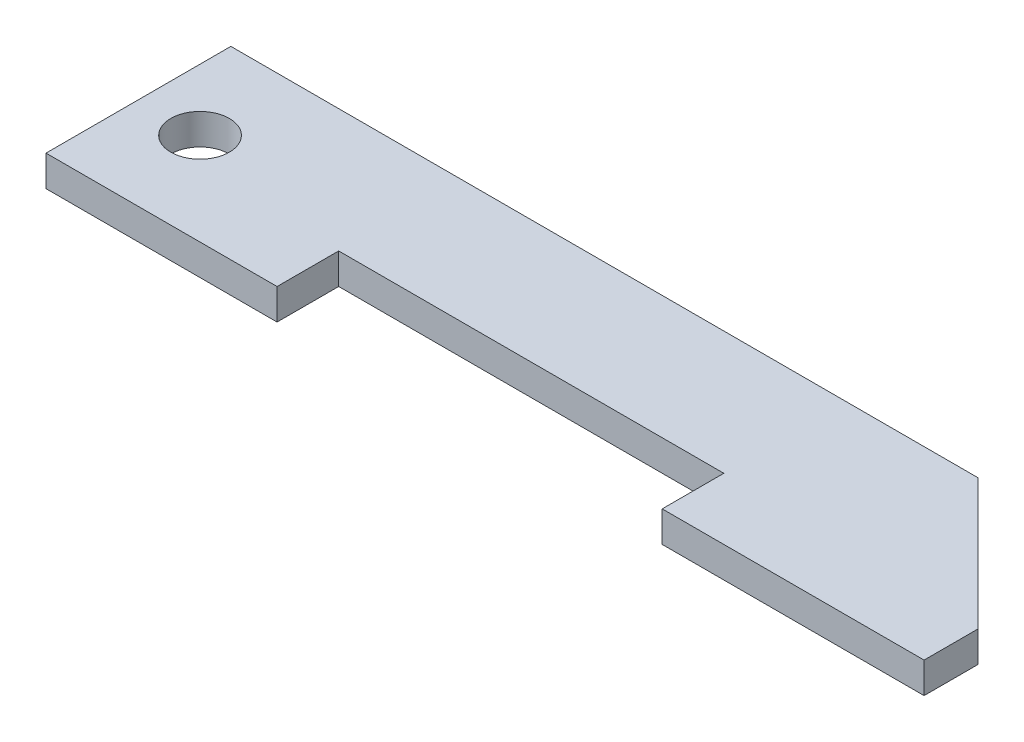
ISO-10303-21;
HEADER;
FILE_DESCRIPTION(('STEP AP214'),'2;1');
FILE_NAME('part.step','',(''),(''),'','','');
FILE_SCHEMA(('AUTOMOTIVE_DESIGN { 1 0 10303 214 1 1 1 1 }'));
ENDSEC;
DATA;
#1=APPLICATION_CONTEXT('core data for automotive mechanical design processes');
#2=APPLICATION_PROTOCOL_DEFINITION('international standard','automotive_design',2000,#1);
#3=PRODUCT_CONTEXT('',#1,'mechanical');
#4=PRODUCT('Part','Part','',(#3));
#5=PRODUCT_RELATED_PRODUCT_CATEGORY('part','',(#4));
#6=PRODUCT_DEFINITION_FORMATION('','',#4);
#7=PRODUCT_DEFINITION_CONTEXT('part definition',#1,'design');
#8=PRODUCT_DEFINITION('design','',#6,#7);
#9=PRODUCT_DEFINITION_SHAPE('','',#8);
#10=(LENGTH_UNIT() NAMED_UNIT(*) SI_UNIT(.MILLI.,.METRE.));
#11=(NAMED_UNIT(*) PLANE_ANGLE_UNIT() SI_UNIT($,.RADIAN.));
#12=(NAMED_UNIT(*) SI_UNIT($,.STERADIAN.) SOLID_ANGLE_UNIT());
#13=UNCERTAINTY_MEASURE_WITH_UNIT(LENGTH_MEASURE(1.E-05),#10,'distance_accuracy_value','');
#14=(GEOMETRIC_REPRESENTATION_CONTEXT(3) GLOBAL_UNCERTAINTY_ASSIGNED_CONTEXT((#13)) GLOBAL_UNIT_ASSIGNED_CONTEXT((#10,
#11,#12)) REPRESENTATION_CONTEXT('',''));
#15=CARTESIAN_POINT('',(0.,0.,0.));
#16=DIRECTION('',(0.,0.,1.));
#17=DIRECTION('',(1.,0.,0.));
#18=AXIS2_PLACEMENT_3D('',#15,#16,#17);
#19=CARTESIAN_POINT('',(0.,2.,0.));
#20=DIRECTION('',(0.,-1.,0.));
#21=DIRECTION('',(0.,0.,-1.));
#22=AXIS2_PLACEMENT_3D('',#19,#20,#21);
#23=PLANE('',#22);
#24=DIRECTION('',(0.,0.,1.));
#25=VECTOR('',#24,1.);
#26=CARTESIAN_POINT('',(0.,2.,12.));
#27=LINE('',#26,#25);
#28=CARTESIAN_POINT('',(0.,2.,0.));
#29=VERTEX_POINT('',#28);
#30=CARTESIAN_POINT('',(0.,2.,12.));
#31=VERTEX_POINT('',#30);
#32=EDGE_CURVE('E151',#29,#31,#27,.T.);
#33=ORIENTED_EDGE('',*,*,#32,.T.);
#34=DIRECTION('',(1.,0.,0.));
#35=VECTOR('',#34,1.);
#36=CARTESIAN_POINT('',(15.,2.,12.));
#37=LINE('',#36,#35);
#38=CARTESIAN_POINT('',(15.,2.,12.));
#39=VERTEX_POINT('',#38);
#40=EDGE_CURVE('E94',#31,#39,#37,.T.);
#41=ORIENTED_EDGE('',*,*,#40,.T.);
#42=DIRECTION('',(0.,0.,-1.));
#43=VECTOR('',#42,1.);
#44=CARTESIAN_POINT('',(15.,2.,8.));
#45=LINE('',#44,#43);
#46=CARTESIAN_POINT('',(15.,2.,8.));
#47=VERTEX_POINT('',#46);
#48=EDGE_CURVE('E169',#39,#47,#45,.T.);
#49=ORIENTED_EDGE('',*,*,#48,.T.);
#50=DIRECTION('',(1.,0.,0.));
#51=VECTOR('',#50,1.);
#52=CARTESIAN_POINT('',(40.,2.,8.));
#53=LINE('',#52,#51);
#54=CARTESIAN_POINT('',(40.,2.,8.));
#55=VERTEX_POINT('',#54);
#56=EDGE_CURVE('E186',#47,#55,#53,.T.);
#57=ORIENTED_EDGE('',*,*,#56,.T.);
#58=DIRECTION('',(0.,0.,1.));
#59=VECTOR('',#58,1.);
#60=CARTESIAN_POINT('',(40.,2.,12.));
#61=LINE('',#60,#59);
#62=CARTESIAN_POINT('',(40.,2.,12.));
#63=VERTEX_POINT('',#62);
#64=EDGE_CURVE('E185',#55,#63,#61,.T.);
#65=ORIENTED_EDGE('',*,*,#64,.T.);
#66=DIRECTION('',(1.,0.,0.));
#67=VECTOR('',#66,1.);
#68=CARTESIAN_POINT('',(57.,2.,12.));
#69=LINE('',#68,#67);
#70=CARTESIAN_POINT('',(57.,2.,12.));
#71=VERTEX_POINT('',#70);
#72=EDGE_CURVE('E116',#63,#71,#69,.T.);
#73=ORIENTED_EDGE('',*,*,#72,.T.);
#74=DIRECTION('',(0.,0.,-1.));
#75=VECTOR('',#74,1.);
#76=CARTESIAN_POINT('',(57.,2.,8.49999999999999));
#77=LINE('',#76,#75);
#78=CARTESIAN_POINT('',(57.,2.,8.49999999999999));
#79=VERTEX_POINT('',#78);
#80=EDGE_CURVE('E110',#71,#79,#77,.T.);
#81=ORIENTED_EDGE('',*,*,#80,.T.);
#82=DIRECTION('',(-0.707106781186552,0.,-0.707106781186543));
#83=VECTOR('',#82,1.);
#84=CARTESIAN_POINT('',(48.4999999999999,2.,0.));
#85=LINE('',#84,#83);
#86=CARTESIAN_POINT('',(48.4999999999999,2.,0.));
#87=VERTEX_POINT('',#86);
#88=EDGE_CURVE('E114',#79,#87,#85,.T.);
#89=ORIENTED_EDGE('',*,*,#88,.T.);
#90=DIRECTION('',(-1.,0.,0.));
#91=VECTOR('',#90,1.);
#92=CARTESIAN_POINT('',(0.,2.,0.));
#93=LINE('',#92,#91);
#94=EDGE_CURVE('E48',#87,#29,#93,.T.);
#95=ORIENTED_EDGE('',*,*,#94,.T.);
#96=EDGE_LOOP('',(#33,#41,#49,#57,#65,#73,#81,#89,#95));
#97=FACE_BOUND('',#96,.T.);
#98=CARTESIAN_POINT('',(4.,2.,6.));
#99=DIRECTION('',(0.,1.,0.));
#100=DIRECTION('',(0.,0.,1.));
#101=AXIS2_PLACEMENT_3D('',#98,#99,#100);
#102=CIRCLE('',#101,1.9);
#103=CARTESIAN_POINT('',(4.,2.,7.9));
#104=VERTEX_POINT('',#103);
#105=EDGE_CURVE('E138',#104,#104,#102,.T.);
#106=ORIENTED_EDGE('',*,*,#105,.F.);
#107=EDGE_LOOP('',(#106));
#108=FACE_BOUND('',#107,.T.);
#109=ADVANCED_FACE('F31',(#97,#108),#23,.F.);
#110=CARTESIAN_POINT('',(0.,0.,0.));
#111=DIRECTION('',(0.,-1.,0.));
#112=DIRECTION('',(0.,0.,-1.));
#113=AXIS2_PLACEMENT_3D('',#110,#111,#112);
#114=PLANE('',#113);
#115=DIRECTION('',(0.,0.,1.));
#116=VECTOR('',#115,1.);
#117=CARTESIAN_POINT('',(0.,0.,12.));
#118=LINE('',#117,#116);
#119=CARTESIAN_POINT('',(0.,0.,0.));
#120=VERTEX_POINT('',#119);
#121=CARTESIAN_POINT('',(0.,0.,12.));
#122=VERTEX_POINT('',#121);
#123=EDGE_CURVE('E134',#120,#122,#118,.T.);
#124=ORIENTED_EDGE('',*,*,#123,.F.);
#125=DIRECTION('',(-1.,0.,0.));
#126=VECTOR('',#125,1.);
#127=CARTESIAN_POINT('',(0.,0.,0.));
#128=LINE('',#127,#126);
#129=CARTESIAN_POINT('',(48.4999999999999,0.,0.));
#130=VERTEX_POINT('',#129);
#131=EDGE_CURVE('E86',#130,#120,#128,.T.);
#132=ORIENTED_EDGE('',*,*,#131,.F.);
#133=DIRECTION('',(-0.707106781186552,0.,-0.707106781186543));
#134=VECTOR('',#133,1.);
#135=CARTESIAN_POINT('',(48.4999999999999,0.,0.));
#136=LINE('',#135,#134);
#137=CARTESIAN_POINT('',(57.,0.,8.49999999999999));
#138=VERTEX_POINT('',#137);
#139=EDGE_CURVE('E80',#138,#130,#136,.T.);
#140=ORIENTED_EDGE('',*,*,#139,.F.);
#141=DIRECTION('',(0.,0.,-1.));
#142=VECTOR('',#141,1.);
#143=CARTESIAN_POINT('',(57.,0.,8.49999999999999));
#144=LINE('',#143,#142);
#145=CARTESIAN_POINT('',(57.,0.,12.));
#146=VERTEX_POINT('',#145);
#147=EDGE_CURVE('E124',#146,#138,#144,.T.);
#148=ORIENTED_EDGE('',*,*,#147,.F.);
#149=DIRECTION('',(1.,0.,0.));
#150=VECTOR('',#149,1.);
#151=CARTESIAN_POINT('',(57.,0.,12.));
#152=LINE('',#151,#150);
#153=CARTESIAN_POINT('',(40.,0.,12.));
#154=VERTEX_POINT('',#153);
#155=EDGE_CURVE('E146',#154,#146,#152,.T.);
#156=ORIENTED_EDGE('',*,*,#155,.F.);
#157=DIRECTION('',(0.,0.,1.));
#158=VECTOR('',#157,1.);
#159=CARTESIAN_POINT('',(40.,0.,12.));
#160=LINE('',#159,#158);
#161=CARTESIAN_POINT('',(40.,0.,8.));
#162=VERTEX_POINT('',#161);
#163=EDGE_CURVE('E144',#162,#154,#160,.T.);
#164=ORIENTED_EDGE('',*,*,#163,.F.);
#165=DIRECTION('',(1.,0.,0.));
#166=VECTOR('',#165,1.);
#167=CARTESIAN_POINT('',(40.,0.,8.));
#168=LINE('',#167,#166);
#169=CARTESIAN_POINT('',(15.,0.,8.));
#170=VERTEX_POINT('',#169);
#171=EDGE_CURVE('E142',#170,#162,#168,.T.);
#172=ORIENTED_EDGE('',*,*,#171,.F.);
#173=DIRECTION('',(0.,0.,-1.));
#174=VECTOR('',#173,1.);
#175=CARTESIAN_POINT('',(15.,0.,8.));
#176=LINE('',#175,#174);
#177=CARTESIAN_POINT('',(15.,0.,12.));
#178=VERTEX_POINT('',#177);
#179=EDGE_CURVE('E140',#178,#170,#176,.T.);
#180=ORIENTED_EDGE('',*,*,#179,.F.);
#181=DIRECTION('',(1.,0.,0.));
#182=VECTOR('',#181,1.);
#183=CARTESIAN_POINT('',(15.,0.,12.));
#184=LINE('',#183,#182);
#185=EDGE_CURVE('E137',#122,#178,#184,.T.);
#186=ORIENTED_EDGE('',*,*,#185,.F.);
#187=EDGE_LOOP('',(#124,#132,#140,#148,#156,#164,#172,#180,#186));
#188=FACE_BOUND('',#187,.T.);
#189=CARTESIAN_POINT('',(4.,0.,6.));
#190=DIRECTION('',(0.,1.,0.));
#191=DIRECTION('',(0.,0.,1.));
#192=AXIS2_PLACEMENT_3D('',#189,#190,#191);
#193=CIRCLE('',#192,1.9);
#194=CARTESIAN_POINT('',(4.,0.,7.9));
#195=VERTEX_POINT('',#194);
#196=EDGE_CURVE('E193',#195,#195,#193,.T.);
#197=ORIENTED_EDGE('',*,*,#196,.T.);
#198=EDGE_LOOP('',(#197));
#199=FACE_BOUND('',#198,.T.);
#200=ADVANCED_FACE('F173',(#188,#199),#114,.T.);
#201=CARTESIAN_POINT('',(0.,2.,12.));
#202=DIRECTION('',(1.,0.,0.));
#203=DIRECTION('',(0.,0.,-1.));
#204=AXIS2_PLACEMENT_3D('',#201,#202,#203);
#205=PLANE('',#204);
#206=ORIENTED_EDGE('',*,*,#123,.T.);
#207=DIRECTION('',(0.,-1.,0.));
#208=VECTOR('',#207,1.);
#209=CARTESIAN_POINT('',(0.,2.,12.));
#210=LINE('',#209,#208);
#211=EDGE_CURVE('E11',#31,#122,#210,.T.);
#212=ORIENTED_EDGE('',*,*,#211,.F.);
#213=ORIENTED_EDGE('',*,*,#32,.F.);
#214=DIRECTION('',(0.,-1.,0.));
#215=VECTOR('',#214,1.);
#216=CARTESIAN_POINT('',(0.,2.,0.));
#217=LINE('',#216,#215);
#218=EDGE_CURVE('E130',#29,#120,#217,.T.);
#219=ORIENTED_EDGE('',*,*,#218,.T.);
#220=EDGE_LOOP('',(#206,#212,#213,#219));
#221=FACE_BOUND('',#220,.T.);
#222=ADVANCED_FACE('F33',(#221),#205,.F.);
#223=CARTESIAN_POINT('',(15.,2.,12.));
#224=DIRECTION('',(0.,0.,-1.));
#225=DIRECTION('',(-1.,0.,0.));
#226=AXIS2_PLACEMENT_3D('',#223,#224,#225);
#227=PLANE('',#226);
#228=ORIENTED_EDGE('',*,*,#185,.T.);
#229=DIRECTION('',(0.,-1.,0.));
#230=VECTOR('',#229,1.);
#231=CARTESIAN_POINT('',(15.,2.,12.));
#232=LINE('',#231,#230);
#233=EDGE_CURVE('E40',#39,#178,#232,.T.);
#234=ORIENTED_EDGE('',*,*,#233,.F.);
#235=ORIENTED_EDGE('',*,*,#40,.F.);
#236=ORIENTED_EDGE('',*,*,#211,.T.);
#237=EDGE_LOOP('',(#228,#234,#235,#236));
#238=FACE_BOUND('',#237,.T.);
#239=ADVANCED_FACE('F225',(#238),#227,.F.);
#240=CARTESIAN_POINT('',(15.,2.,8.));
#241=DIRECTION('',(-1.,0.,0.));
#242=DIRECTION('',(0.,0.,1.));
#243=AXIS2_PLACEMENT_3D('',#240,#241,#242);
#244=PLANE('',#243);
#245=ORIENTED_EDGE('',*,*,#179,.T.);
#246=DIRECTION('',(0.,-1.,0.));
#247=VECTOR('',#246,1.);
#248=CARTESIAN_POINT('',(15.,2.,8.));
#249=LINE('',#248,#247);
#250=EDGE_CURVE('E161',#47,#170,#249,.T.);
#251=ORIENTED_EDGE('',*,*,#250,.F.);
#252=ORIENTED_EDGE('',*,*,#48,.F.);
#253=ORIENTED_EDGE('',*,*,#233,.T.);
#254=EDGE_LOOP('',(#245,#251,#252,#253));
#255=FACE_BOUND('',#254,.T.);
#256=ADVANCED_FACE('F167',(#255),#244,.F.);
#257=CARTESIAN_POINT('',(40.,2.,8.));
#258=DIRECTION('',(0.,0.,-1.));
#259=DIRECTION('',(-1.,0.,0.));
#260=AXIS2_PLACEMENT_3D('',#257,#258,#259);
#261=PLANE('',#260);
#262=ORIENTED_EDGE('',*,*,#171,.T.);
#263=DIRECTION('',(0.,-1.,0.));
#264=VECTOR('',#263,1.);
#265=CARTESIAN_POINT('',(40.,2.,8.));
#266=LINE('',#265,#264);
#267=EDGE_CURVE('E158',#55,#162,#266,.T.);
#268=ORIENTED_EDGE('',*,*,#267,.F.);
#269=ORIENTED_EDGE('',*,*,#56,.F.);
#270=ORIENTED_EDGE('',*,*,#250,.T.);
#271=EDGE_LOOP('',(#262,#268,#269,#270));
#272=FACE_BOUND('',#271,.T.);
#273=ADVANCED_FACE('F179',(#272),#261,.F.);
#274=CARTESIAN_POINT('',(40.,2.,12.));
#275=DIRECTION('',(1.,0.,0.));
#276=DIRECTION('',(0.,0.,-1.));
#277=AXIS2_PLACEMENT_3D('',#274,#275,#276);
#278=PLANE('',#277);
#279=ORIENTED_EDGE('',*,*,#163,.T.);
#280=DIRECTION('',(0.,-1.,0.));
#281=VECTOR('',#280,1.);
#282=CARTESIAN_POINT('',(40.,2.,12.));
#283=LINE('',#282,#281);
#284=EDGE_CURVE('E155',#63,#154,#283,.T.);
#285=ORIENTED_EDGE('',*,*,#284,.F.);
#286=ORIENTED_EDGE('',*,*,#64,.F.);
#287=ORIENTED_EDGE('',*,*,#267,.T.);
#288=EDGE_LOOP('',(#279,#285,#286,#287));
#289=FACE_BOUND('',#288,.T.);
#290=ADVANCED_FACE('F183',(#289),#278,.F.);
#291=CARTESIAN_POINT('',(57.,2.,12.));
#292=DIRECTION('',(0.,0.,-1.));
#293=DIRECTION('',(-1.,0.,0.));
#294=AXIS2_PLACEMENT_3D('',#291,#292,#293);
#295=PLANE('',#294);
#296=ORIENTED_EDGE('',*,*,#155,.T.);
#297=DIRECTION('',(0.,-1.,0.));
#298=VECTOR('',#297,1.);
#299=CARTESIAN_POINT('',(57.,2.,12.));
#300=LINE('',#299,#298);
#301=EDGE_CURVE('E125',#71,#146,#300,.T.);
#302=ORIENTED_EDGE('',*,*,#301,.F.);
#303=ORIENTED_EDGE('',*,*,#72,.F.);
#304=ORIENTED_EDGE('',*,*,#284,.T.);
#305=EDGE_LOOP('',(#296,#302,#303,#304));
#306=FACE_BOUND('',#305,.T.);
#307=ADVANCED_FACE('F216',(#306),#295,.F.);
#308=CARTESIAN_POINT('',(57.,2.,8.49999999999999));
#309=DIRECTION('',(-1.,0.,0.));
#310=DIRECTION('',(0.,0.,1.));
#311=AXIS2_PLACEMENT_3D('',#308,#309,#310);
#312=PLANE('',#311);
#313=ORIENTED_EDGE('',*,*,#147,.T.);
#314=DIRECTION('',(0.,-1.,0.));
#315=VECTOR('',#314,1.);
#316=CARTESIAN_POINT('',(57.,2.,8.49999999999999));
#317=LINE('',#316,#315);
#318=EDGE_CURVE('E121',#79,#138,#317,.T.);
#319=ORIENTED_EDGE('',*,*,#318,.F.);
#320=ORIENTED_EDGE('',*,*,#80,.F.);
#321=ORIENTED_EDGE('',*,*,#301,.T.);
#322=EDGE_LOOP('',(#313,#319,#320,#321));
#323=FACE_BOUND('',#322,.T.);
#324=ADVANCED_FACE('F122',(#323),#312,.F.);
#325=CARTESIAN_POINT('',(48.4999999999999,2.,0.));
#326=DIRECTION('',(-0.707106781186543,0.,0.707106781186552));
#327=DIRECTION('',(0.707106781186552,0.,0.707106781186543));
#328=AXIS2_PLACEMENT_3D('',#325,#326,#327);
#329=PLANE('',#328);
#330=ORIENTED_EDGE('',*,*,#139,.T.);
#331=DIRECTION('',(0.,-1.,0.));
#332=VECTOR('',#331,1.);
#333=CARTESIAN_POINT('',(48.4999999999999,2.,0.));
#334=LINE('',#333,#332);
#335=EDGE_CURVE('E126',#87,#130,#334,.T.);
#336=ORIENTED_EDGE('',*,*,#335,.F.);
#337=ORIENTED_EDGE('',*,*,#88,.F.);
#338=ORIENTED_EDGE('',*,*,#318,.T.);
#339=EDGE_LOOP('',(#330,#336,#337,#338));
#340=FACE_BOUND('',#339,.T.);
#341=ADVANCED_FACE('F128',(#340),#329,.F.);
#342=CARTESIAN_POINT('',(0.,2.,0.));
#343=DIRECTION('',(0.,0.,1.));
#344=DIRECTION('',(1.,0.,0.));
#345=AXIS2_PLACEMENT_3D('',#342,#343,#344);
#346=PLANE('',#345);
#347=ORIENTED_EDGE('',*,*,#131,.T.);
#348=ORIENTED_EDGE('',*,*,#218,.F.);
#349=ORIENTED_EDGE('',*,*,#94,.F.);
#350=ORIENTED_EDGE('',*,*,#335,.T.);
#351=EDGE_LOOP('',(#347,#348,#349,#350));
#352=FACE_BOUND('',#351,.T.);
#353=ADVANCED_FACE('F209',(#352),#346,.F.);
#354=CARTESIAN_POINT('',(4.,2.,6.));
#355=DIRECTION('',(0.,-1.,0.));
#356=DIRECTION('',(0.,0.,-1.));
#357=AXIS2_PLACEMENT_3D('',#354,#355,#356);
#358=CYLINDRICAL_SURFACE('',#357,1.9);
#359=ORIENTED_EDGE('',*,*,#105,.T.);
#360=EDGE_LOOP('',(#359));
#361=FACE_BOUND('',#360,.T.);
#362=ORIENTED_EDGE('',*,*,#196,.F.);
#363=EDGE_LOOP('',(#362));
#364=FACE_BOUND('',#363,.T.);
#365=ADVANCED_FACE('F199',(#361,#364),#358,.F.);
#366=CLOSED_SHELL('',(#109,#200,#222,#239,#256,#273,#290,#307,#324,#341,#353,#365));
#367=MANIFOLD_SOLID_BREP('B2',#366);
#368=ADVANCED_BREP_SHAPE_REPRESENTATION('',(#18,#367),#14);
#369=SHAPE_DEFINITION_REPRESENTATION(#9,#368);
ENDSEC;
END-ISO-10303-21;
